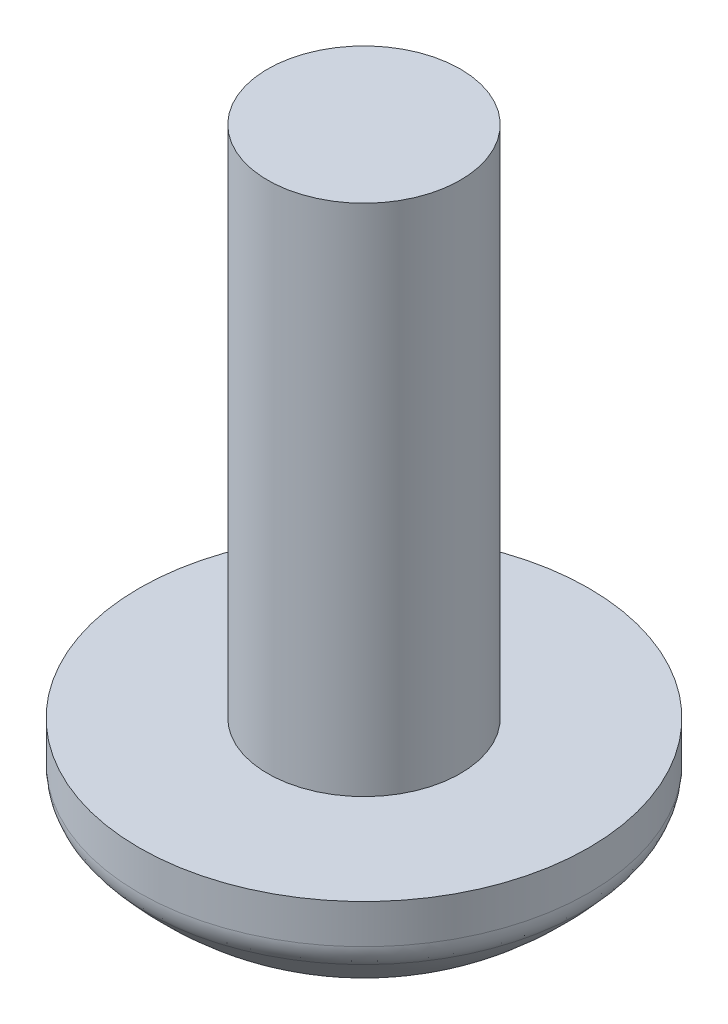
ISO-10303-21;
HEADER;
FILE_DESCRIPTION(('STEP AP214'),'2;1');
FILE_NAME('part.step','',(''),(''),'','','');
FILE_SCHEMA(('AUTOMOTIVE_DESIGN { 1 0 10303 214 1 1 1 1 }'));
ENDSEC;
DATA;
#1=APPLICATION_CONTEXT('core data for automotive mechanical design processes');
#2=APPLICATION_PROTOCOL_DEFINITION('international standard','automotive_design',2000,#1);
#3=PRODUCT_CONTEXT('',#1,'mechanical');
#4=PRODUCT('Part','Part','',(#3));
#5=PRODUCT_RELATED_PRODUCT_CATEGORY('part','',(#4));
#6=PRODUCT_DEFINITION_FORMATION('','',#4);
#7=PRODUCT_DEFINITION_CONTEXT('part definition',#1,'design');
#8=PRODUCT_DEFINITION('design','',#6,#7);
#9=PRODUCT_DEFINITION_SHAPE('','',#8);
#10=(LENGTH_UNIT() NAMED_UNIT(*) SI_UNIT(.MILLI.,.METRE.));
#11=(NAMED_UNIT(*) PLANE_ANGLE_UNIT() SI_UNIT($,.RADIAN.));
#12=(NAMED_UNIT(*) SI_UNIT($,.STERADIAN.) SOLID_ANGLE_UNIT());
#13=UNCERTAINTY_MEASURE_WITH_UNIT(LENGTH_MEASURE(1.E-05),#10,'distance_accuracy_value','');
#14=(GEOMETRIC_REPRESENTATION_CONTEXT(3) GLOBAL_UNCERTAINTY_ASSIGNED_CONTEXT((#13)) GLOBAL_UNIT_ASSIGNED_CONTEXT((#10,
#11,#12)) REPRESENTATION_CONTEXT('',''));
#15=CARTESIAN_POINT('',(0.,0.,0.));
#16=DIRECTION('',(0.,0.,1.));
#17=DIRECTION('',(1.,0.,0.));
#18=AXIS2_PLACEMENT_3D('',#15,#16,#17);
#19=CARTESIAN_POINT('',(0.,-0.459726703238766,1.68219997316542));
#20=DIRECTION('',(0.,-1.,0.));
#21=DIRECTION('',(0.,0.,-1.));
#22=AXIS2_PLACEMENT_3D('',#19,#20,#21);
#23=CYLINDRICAL_SURFACE('',#22,3.5);
#24=CARTESIAN_POINT('',(0.,-1.06903181876256,1.68219997316542));
#25=DIRECTION('',(0.,1.,0.));
#26=DIRECTION('',(0.,0.,1.));
#27=AXIS2_PLACEMENT_3D('',#24,#25,#26);
#28=CIRCLE('',#27,3.5);
#29=CARTESIAN_POINT('',(0.,-1.06903181876256,5.18219997316543));
#30=VERTEX_POINT('',#29);
#31=EDGE_CURVE('E386',#30,#30,#28,.T.);
#32=ORIENTED_EDGE('',*,*,#31,.T.);
#33=EDGE_LOOP('',(#32));
#34=FACE_BOUND('',#33,.T.);
#35=CARTESIAN_POINT('',(0.,-0.459726703238766,1.68219997316542));
#36=DIRECTION('',(0.,-1.,0.));
#37=DIRECTION('',(0.,0.,-1.));
#38=AXIS2_PLACEMENT_3D('',#35,#36,#37);
#39=CIRCLE('',#38,3.5);
#40=CARTESIAN_POINT('',(0.,-0.459726703238766,-1.81780002683458));
#41=VERTEX_POINT('',#40);
#42=EDGE_CURVE('E380',#41,#41,#39,.T.);
#43=ORIENTED_EDGE('',*,*,#42,.T.);
#44=EDGE_LOOP('',(#43));
#45=FACE_BOUND('',#44,.T.);
#46=ADVANCED_FACE('F38',(#34,#45),#23,.T.);
#47=CARTESIAN_POINT('',(0.,-0.459726703238766,-1.81780002683458));
#48=DIRECTION('',(0.,1.,0.));
#49=DIRECTION('',(0.,0.,1.));
#50=AXIS2_PLACEMENT_3D('',#47,#48,#49);
#51=PLANE('',#50);
#52=CARTESIAN_POINT('',(0.,-0.459726703238766,1.68219997316542));
#53=DIRECTION('',(0.,-1.,0.));
#54=DIRECTION('',(0.,0.,-1.));
#55=AXIS2_PLACEMENT_3D('',#52,#53,#54);
#56=CIRCLE('',#55,1.5);
#57=CARTESIAN_POINT('',(0.,-0.459726703238766,0.182199973165424));
#58=VERTEX_POINT('',#57);
#59=EDGE_CURVE('E379',#58,#58,#56,.T.);
#60=ORIENTED_EDGE('',*,*,#59,.T.);
#61=EDGE_LOOP('',(#60));
#62=FACE_BOUND('',#61,.T.);
#63=ORIENTED_EDGE('',*,*,#42,.F.);
#64=EDGE_LOOP('',(#63));
#65=FACE_BOUND('',#64,.T.);
#66=ADVANCED_FACE('F358',(#62,#65),#51,.T.);
#67=CARTESIAN_POINT('',(0.,-0.459726703238766,1.68219997316542));
#68=DIRECTION('',(0.,-1.,0.));
#69=DIRECTION('',(0.,0.,-1.));
#70=AXIS2_PLACEMENT_3D('',#67,#68,#69);
#71=CYLINDRICAL_SURFACE('',#70,1.5);
#72=CARTESIAN_POINT('',(0.,7.54027329676123,1.68219997316542));
#73=DIRECTION('',(0.,-1.,0.));
#74=DIRECTION('',(0.,0.,-1.));
#75=AXIS2_PLACEMENT_3D('',#72,#73,#74);
#76=CIRCLE('',#75,1.5);
#77=CARTESIAN_POINT('',(0.,7.54027329676123,0.182199973165424));
#78=VERTEX_POINT('',#77);
#79=EDGE_CURVE('E181',#78,#78,#76,.T.);
#80=ORIENTED_EDGE('',*,*,#79,.T.);
#81=EDGE_LOOP('',(#80));
#82=FACE_BOUND('',#81,.T.);
#83=ORIENTED_EDGE('',*,*,#59,.F.);
#84=EDGE_LOOP('',(#83));
#85=FACE_BOUND('',#84,.T.);
#86=ADVANCED_FACE('F363',(#82,#85),#71,.T.);
#87=CARTESIAN_POINT('',(0.,7.54027329676123,1.68219997316542));
#88=DIRECTION('',(0.,1.,0.));
#89=DIRECTION('',(0.,0.,1.));
#90=AXIS2_PLACEMENT_3D('',#87,#88,#89);
#91=PLANE('',#90);
#92=ORIENTED_EDGE('',*,*,#79,.F.);
#93=EDGE_LOOP('',(#92));
#94=FACE_BOUND('',#93,.T.);
#95=ADVANCED_FACE('F221',(#94),#91,.T.);
#96=CARTESIAN_POINT('',(0.,-2.95972670323877,1.68219997316542));
#97=CARTESIAN_POINT('',(0.,-2.84056430752141,-0.306624250082899));
#98=CARTESIAN_POINT('',(0.,-2.02578844036261,-1.17776825899481));
#99=CARTESIAN_POINT('',(0.,-1.25200758538791,-1.81780002683458));
#100=B_SPLINE_CURVE_WITH_KNOTS('',3,(#96,#97,#98,#99),.UNSPECIFIED.,.F.,.F.,(4,4),(0.,1.),.UNSPECIFIED.);
#101=CARTESIAN_POINT('',(0.,-0.459726703238766,1.68219997316542));
#102=DIRECTION('',(0.,-1.,0.));
#103=AXIS1_PLACEMENT('',#101,#102);
#104=SURFACE_OF_REVOLUTION('',#100,#103);
#105=CARTESIAN_POINT('',(2.75,-1.97538266649737,1.18219997316542));
#106=CARTESIAN_POINT('',(2.75,-1.99569644264163,1.31884592915908));
#107=CARTESIAN_POINT('',(2.75,-2.00760769847933,1.45678441371395));
#108=CARTESIAN_POINT('',(2.75,-2.01462594430466,1.73186986015496));
#109=CARTESIAN_POINT('',(2.75,-2.00988032499229,1.86901306244241));
#110=CARTESIAN_POINT('',(2.75,-1.99128308097446,2.06446422432555));
#111=CARTESIAN_POINT('',(2.75,-1.98410653292702,2.12345411393049));
#112=CARTESIAN_POINT('',(2.75,-1.97538266649739,2.18219997316528));
#113=B_SPLINE_CURVE_WITH_KNOTS('',3,(#105,#106,#107,#108,#109,#110,#111,#112),.UNSPECIFIED.,.F.,
.F.,(4,2,2,4),(0.,0.414282206966455,0.824907856417591,1.00309698316107),.UNSPECIFIED.);
#114=CARTESIAN_POINT('',(2.75,-1.97538266649737,1.18219997316542));
#115=VERTEX_POINT('',#114);
#116=CARTESIAN_POINT('',(2.74999999999941,-1.97538266649841,2.18219997316538));
#117=VERTEX_POINT('',#116);
#118=EDGE_CURVE('E11',#115,#117,#113,.T.);
#119=ORIENTED_EDGE('',*,*,#118,.F.);
#120=CARTESIAN_POINT('',(0.470758808281623,-2.88524026338165,1.18219997316542));
#121=CARTESIAN_POINT('',(0.542004662792417,-2.87729764894664,1.18219997316542));
#122=CARTESIAN_POINT('',(0.613084927522149,-2.86787744344801,1.18219997316542));
#123=CARTESIAN_POINT('',(0.754789135833399,-2.84609599033659,1.18219997316542));
#124=CARTESIAN_POINT('',(0.82541310569823,-2.83373491370235,1.18219997316542));
#125=CARTESIAN_POINT('',(0.966589136260527,-2.80598641126095,1.18219997316542));
#126=CARTESIAN_POINT('',(1.03713709796704,-2.79057804661767,1.18219997316542));
#127=CARTESIAN_POINT('',(1.17750091286694,-2.7566723016444,1.18219997316542));
#128=CARTESIAN_POINT('',(1.24731660322234,-2.73817424910348,1.18219997316542));
#129=CARTESIAN_POINT('',(1.43028236330932,-2.68511600210193,1.18219997316542));
#130=CARTESIAN_POINT('',(1.54266215682314,-2.64783760861366,1.18219997316542));
#131=CARTESIAN_POINT('',(1.76392187081325,-2.56403195600538,1.18219997316542));
#132=CARTESIAN_POINT('',(1.87280218936971,-2.5175057532197,1.18219997316542));
#133=CARTESIAN_POINT('',(2.08557033138529,-2.41504988061442,1.18219997316542));
#134=CARTESIAN_POINT('',(2.18947495773862,-2.35915522490493,1.18219997316543));
#135=CARTESIAN_POINT('',(2.39160318575382,-2.23799140705744,1.18219997316542));
#136=CARTESIAN_POINT('',(2.48983057788307,-2.17272860349497,1.18219997316542));
#137=CARTESIAN_POINT('',(2.61293513880044,-2.082598544664,1.18219997316542));
#138=CARTESIAN_POINT('',(2.64074499785162,-2.0616561868157,1.18219997316542));
#139=CARTESIAN_POINT('',(2.6957963360839,-2.01905281083415,1.18219997316542));
#140=CARTESIAN_POINT('',(2.72303797246467,-1.99739199587632,1.18219997316543));
#141=CARTESIAN_POINT('',(2.75,-1.97538266649737,1.18219997316542));
#142=B_SPLINE_CURVE_WITH_KNOTS('',3,(#120,#121,#122,#123,#124,#125,#126,#127,#128,#129,#130,
#131,#132,#133,#134,#135,#136,#137,#138,#139,#140,#141),.UNSPECIFIED.,.F.,.F.,(4,2,2,2,2,2,2,2,
2,2,4),(0.,0.215044445767002,0.430076392175597,0.646640714015064,0.863252214400839,
1.21805973275493,1.5728267463592,1.92629625298131,2.27952696882037,2.38395933727035,
2.48836242052614),.UNSPECIFIED.);
#143=CARTESIAN_POINT('',(0.470758808281623,-2.88524026338165,1.18219997316542));
#144=VERTEX_POINT('',#143);
#145=EDGE_CURVE('E52',#144,#115,#142,.T.);
#146=ORIENTED_EDGE('',*,*,#145,.F.);
#147=CARTESIAN_POINT('',(0.470758808281623,-1.97525155911593,-1.07311660714701));
#148=CARTESIAN_POINT('',(0.470758808281623,-2.01874918811076,-1.01996401393127));
#149=CARTESIAN_POINT('',(0.470758808281623,-2.06087772019004,-0.965685121883624));
#150=CARTESIAN_POINT('',(0.470758808281623,-2.14220994860475,-0.854989319968206));
#151=CARTESIAN_POINT('',(0.470758808281623,-2.18141398963491,-0.798572663253516));
#152=CARTESIAN_POINT('',(0.470758808281623,-2.25666361013854,-0.683790774248284));
#153=CARTESIAN_POINT('',(0.470758808281623,-2.29271390848188,-0.625428640127099));
#154=CARTESIAN_POINT('',(0.470758808281623,-2.36163139620041,-0.506852240749729));
#155=CARTESIAN_POINT('',(0.470758808281623,-2.3944982441221,-0.44663777772535));
#156=CARTESIAN_POINT('',(0.470758808281623,-2.47989605606271,-0.279857537145908));
#157=CARTESIAN_POINT('',(0.470758808281623,-2.529210209052,-0.171627095905495));
#158=CARTESIAN_POINT('',(0.470758808281623,-2.61840493355439,0.0486843638263002));
#159=CARTESIAN_POINT('',(0.470758808281623,-2.65828008096221,0.160767554133868));
#160=CARTESIAN_POINT('',(0.470758808281623,-2.72916737233799,0.387765838494003));
#161=CARTESIAN_POINT('',(0.470758808281623,-2.76017316193603,0.502682899140694));
#162=CARTESIAN_POINT('',(0.470758808281623,-2.8139396884138,0.734384826786136));
#163=CARTESIAN_POINT('',(0.470758808281623,-2.83670324075088,0.85116904172534));
#164=CARTESIAN_POINT('',(0.470758808281623,-2.8612007123161,1.00406647677717));
#165=CARTESIAN_POINT('',(0.470758808281623,-2.86652801358584,1.03963011141194));
#166=CARTESIAN_POINT('',(0.470758808281623,-2.87644222603422,1.11084672067808));
#167=CARTESIAN_POINT('',(0.470758808281623,-2.88102941552799,1.14649965658228));
#168=CARTESIAN_POINT('',(0.470758808281623,-2.88524026338165,1.18219997316542));
#169=B_SPLINE_CURVE_WITH_KNOTS('',3,(#147,#148,#149,#150,#151,#152,#153,#154,#155,#156,#157,
#158,#159,#160,#161,#162,#163,#164,#165,#166,#167,#168),.UNSPECIFIED.,.F.,.F.,(4,2,2,2,2,2,2,2,
2,2,4),(0.,0.2060304282566,0.412036534270806,0.617728929060412,0.823443361822867,
1.17974146856868,1.53624382693165,1.89300096207462,2.24963611769048,2.35751238140376,
2.46534798378893),.UNSPECIFIED.);
#170=CARTESIAN_POINT('',(0.470758808281623,-1.97525155911593,-1.07311660714701));
#171=VERTEX_POINT('',#170);
#172=EDGE_CURVE('E301',#171,#144,#169,.T.);
#173=ORIENTED_EDGE('',*,*,#172,.F.);
#174=CARTESIAN_POINT('',(-0.529241191718377,-1.96655788002632,-1.07311660714701));
#175=CARTESIAN_POINT('',(-0.392225096877313,-1.98818427939214,-1.07311660714701));
#176=CARTESIAN_POINT('',(-0.253826941492258,-2.00133118631484,-1.07311660714701));
#177=CARTESIAN_POINT('',(0.0223085454396417,-2.01064916382581,-1.07311660714701));
#178=CARTESIAN_POINT('',(0.16004082065965,-2.00697004687227,-1.07311660714701));
#179=CARTESIAN_POINT('',(0.35507930449322,-1.98990183918733,-1.07311660714701));
#180=CARTESIAN_POINT('',(0.413030567057368,-1.98332350013926,-1.07311660714701));
#181=CARTESIAN_POINT('',(0.470758808281623,-1.97525155911593,-1.07311660714701));
#182=B_SPLINE_CURVE_WITH_KNOTS('',3,(#174,#175,#176,#177,#178,#179,#180,#181),.UNSPECIFIED.,.F.,
.F.,(4,2,2,4),(0.,0.415973375059245,0.828250329477264,1.00313958524149),.UNSPECIFIED.);
#183=CARTESIAN_POINT('',(-0.529241191718377,-1.96655788002632,-1.07311660714701));
#184=VERTEX_POINT('',#183);
#185=EDGE_CURVE('E294',#184,#171,#182,.T.);
#186=ORIENTED_EDGE('',*,*,#185,.F.);
#187=CARTESIAN_POINT('',(-0.529241191718377,-2.87839874159951,1.18219997316542));
#188=CARTESIAN_POINT('',(-0.529241191718377,-2.86995991088716,1.10980388341635));
#189=CARTESIAN_POINT('',(-0.529241191718377,-2.85999301826502,1.03758588342592));
#190=CARTESIAN_POINT('',(-0.529241191718377,-2.83700047184,0.893640399926071));
#191=CARTESIAN_POINT('',(-0.529241191718377,-2.82397489125739,0.821912904717018));
#192=CARTESIAN_POINT('',(-0.529241191718377,-2.79476040614694,0.678581204966709));
#193=CARTESIAN_POINT('',(-0.529241191718377,-2.77855007313706,0.606981349211547));
#194=CARTESIAN_POINT('',(-0.529241191718377,-2.7428974871617,0.464577428181727));
#195=CARTESIAN_POINT('',(-0.529241191718377,-2.7234545838682,0.393773526103151));
#196=CARTESIAN_POINT('',(-0.529241191718376,-2.66868796999526,0.211568073592224));
#197=CARTESIAN_POINT('',(-0.529241191718377,-2.63077382687567,0.100928563411789));
#198=CARTESIAN_POINT('',(-0.529241191718377,-2.54585150811531,-0.116806525686358));
#199=CARTESIAN_POINT('',(-0.529241191718377,-2.49884432497134,-0.223902489886186));
#200=CARTESIAN_POINT('',(-0.529241191718377,-2.39564022777442,-0.433105411385817));
#201=CARTESIAN_POINT('',(-0.529241191718377,-2.33947700379817,-0.535228940187176));
#202=CARTESIAN_POINT('',(-0.529241191718377,-2.21804212275881,-0.733846325862485));
#203=CARTESIAN_POINT('',(-0.529241191718378,-2.15277647142804,-0.830343835702906));
#204=CARTESIAN_POINT('',(-0.529241191718377,-2.06448755679478,-0.949060203647979));
#205=CARTESIAN_POINT('',(-0.529241191718377,-2.04531089179406,-0.974200108690336));
#206=CARTESIAN_POINT('',(-0.529241191718377,-2.00637060439221,-1.02400886725635));
#207=CARTESIAN_POINT('',(-0.529241191718377,-1.98660716312019,-1.04867786235811));
#208=CARTESIAN_POINT('',(-0.529241191718377,-1.96655788002632,-1.07311660714701));
#209=B_SPLINE_CURVE_WITH_KNOTS('',3,(#187,#188,#189,#190,#191,#192,#193,#194,#195,#196,#197,
#198,#199,#200,#201,#202,#203,#204,#205,#206,#207,#208),.UNSPECIFIED.,.F.,.F.,(4,2,2,2,2,2,2,2,
2,2,4),(0.,0.218642096423898,0.437278959427696,0.657440667906297,0.877646722198846,
1.22812112752948,1.57855730047016,1.92773198291301,2.27667736220282,2.3715290000891,
2.46635165701784),.UNSPECIFIED.);
#210=CARTESIAN_POINT('',(-0.529241191718377,-2.87839874159951,1.18219997316542));
#211=VERTEX_POINT('',#210);
#212=EDGE_CURVE('E286',#211,#184,#209,.T.);
#213=ORIENTED_EDGE('',*,*,#212,.F.);
#214=CARTESIAN_POINT('',(-2.75,-1.97538266649736,1.18219997316542));
#215=CARTESIAN_POINT('',(-2.69681334278906,-2.01882217781939,1.18219997316542));
#216=CARTESIAN_POINT('',(-2.64250138570515,-2.06089103555264,1.18219997316542));
#217=CARTESIAN_POINT('',(-2.53174206361007,-2.14210143520268,1.18219997316542));
#218=CARTESIAN_POINT('',(-2.47529495132573,-2.18124332194674,1.18219997316542));
#219=CARTESIAN_POINT('',(-2.3604440223686,-2.25637431661225,1.18219997316542));
#220=CARTESIAN_POINT('',(-2.30204289653258,-2.29236753194934,1.18219997316542));
#221=CARTESIAN_POINT('',(-2.18339135098548,-2.36116817137666,1.18219997316542));
#222=CARTESIAN_POINT('',(-2.12314073577824,-2.39397525714744,1.18219997316542));
#223=CARTESIAN_POINT('',(-1.95632100514546,-2.47917843589097,1.18219997316542));
#224=CARTESIAN_POINT('',(-1.84809281508346,-2.52836043314668,1.18219997316542));
#225=CARTESIAN_POINT('',(-1.6277963203827,-2.61729305268747,1.18219997316542));
#226=CARTESIAN_POINT('',(-1.51572581799735,-2.65703817063432,1.18219997316542));
#227=CARTESIAN_POINT('',(-1.28878496242494,-2.72765176617234,1.18219997316542));
#228=CARTESIAN_POINT('',(-1.17391322502807,-2.75851575468794,1.18219997316542));
#229=CARTESIAN_POINT('',(-0.9423095906536,-2.81197628586008,1.18219997316542));
#230=CARTESIAN_POINT('',(-0.825578422784906,-2.83457598964816,1.18219997316542));
#231=CARTESIAN_POINT('',(-0.678481645509904,-2.8579101692125,1.18219997316542));
#232=CARTESIAN_POINT('',(-0.648678795283765,-2.86237513238264,1.18219997316542));
#233=CARTESIAN_POINT('',(-0.589009288130021,-2.87078138350605,1.18219997316542));
#234=CARTESIAN_POINT('',(-0.559142655233716,-2.87472284209687,1.18219997316542));
#235=CARTESIAN_POINT('',(-0.529241191718373,-2.87839874159951,1.18219997316542));
#236=B_SPLINE_CURVE_WITH_KNOTS('',3,(#214,#215,#216,#217,#218,#219,#220,#221,#222,#223,#224,
#225,#226,#227,#228,#229,#230,#231,#232,#233,#234,#235),.UNSPECIFIED.,.F.,.F.,(4,2,2,2,2,2,2,2,
2,2,4),(0.,0.205999110528866,0.411973913885809,0.617675888299581,0.82339968136858,
1.17952810329957,1.53586374013494,1.89237917605537,2.24875809998541,2.33916188796546,
2.4295361359193),.UNSPECIFIED.);
#237=CARTESIAN_POINT('',(-2.75,-1.97538266649736,1.18219997316542));
#238=VERTEX_POINT('',#237);
#239=EDGE_CURVE('E278',#238,#211,#236,.T.);
#240=ORIENTED_EDGE('',*,*,#239,.F.);
#241=CARTESIAN_POINT('',(-2.74999999999905,-1.97538266649909,2.18219997316526));
#242=CARTESIAN_POINT('',(-2.74999999999966,-1.99569644264225,2.04555401717161));
#243=CARTESIAN_POINT('',(-2.74999999999991,-2.00760769847949,1.9076155326168));
#244=CARTESIAN_POINT('',(-2.75000000000009,-2.01462594430449,1.63253008617593));
#245=CARTESIAN_POINT('',(-2.75000000000003,-2.00988032499224,1.49538688388855));
#246=CARTESIAN_POINT('',(-2.74999999999999,-1.99128308097449,1.29993572200538));
#247=CARTESIAN_POINT('',(-2.74999999999998,-1.98410653292704,1.24094583240032));
#248=CARTESIAN_POINT('',(-2.75,-1.97538266649736,1.18219997316542));
#249=B_SPLINE_CURVE_WITH_KNOTS('',3,(#241,#242,#243,#244,#245,#246,#247,#248),.UNSPECIFIED.,.F.,
.F.,(4,2,2,4),(0.,0.414282206966154,0.824907856417095,1.0030969831609),.UNSPECIFIED.);
#250=CARTESIAN_POINT('',(-2.75,-1.97538266649909,2.18219997316542));
#251=VERTEX_POINT('',#250);
#252=EDGE_CURVE('E270',#251,#238,#249,.T.);
#253=ORIENTED_EDGE('',*,*,#252,.F.);
#254=CARTESIAN_POINT('',(-0.529241191718377,-2.87839874159951,2.18219997316542));
#255=CARTESIAN_POINT('',(-0.602336638562616,-2.86938318800737,2.18219997316542));
#256=CARTESIAN_POINT('',(-0.675245075878459,-2.8588353494829,2.18219997316542));
#257=CARTESIAN_POINT('',(-0.820540862391529,-2.83464748041608,2.18219997316542));
#258=CARTESIAN_POINT('',(-0.892928252651024,-2.82100769635604,2.18219997316542));
#259=CARTESIAN_POINT('',(-1.03604283766155,-2.79081861718261,2.18219997316542));
#260=CARTESIAN_POINT('',(-1.10677911278365,-2.77431249596757,2.18219997316542));
#261=CARTESIAN_POINT('',(-1.24745940091214,-2.73812741622443,2.18219997316542));
#262=CARTESIAN_POINT('',(-1.31740317381364,-2.7184475222669,2.18219997316542));
#263=CARTESIAN_POINT('',(-1.46825312750653,-2.67209538130628,2.18219997316542));
#264=CARTESIAN_POINT('',(-1.54897017113093,-2.64480257051819,2.18219997316542));
#265=CARTESIAN_POINT('',(-1.70865153476749,-2.58543986499239,2.18219997316542));
#266=CARTESIAN_POINT('',(-1.78761551251492,-2.55336904666911,2.18219997316542));
#267=CARTESIAN_POINT('',(-1.94335050837755,-2.48430575746703,2.18219997316542));
#268=CARTESIAN_POINT('',(-2.02012190659136,-2.44731414600962,2.18219997316542));
#269=CARTESIAN_POINT('',(-2.1728943180138,-2.36740692002348,2.18219997316542));
#270=CARTESIAN_POINT('',(-2.24883193740333,-2.32436980203009,2.18219997316542));
#271=CARTESIAN_POINT('',(-2.39760702571394,-2.23315476006569,2.18219997316542));
#272=CARTESIAN_POINT('',(-2.47044284375759,-2.18497414523892,2.18219997316542));
#273=CARTESIAN_POINT('',(-2.61280402132457,-2.08374243289212,2.18219997316542));
#274=CARTESIAN_POINT('',(-2.68232455727412,-2.0306845489376,2.18219997316543));
#275=CARTESIAN_POINT('',(-2.74999999999881,-1.97538266649834,2.18219997316543));
#276=B_SPLINE_CURVE_WITH_KNOTS('',3,(#254,#255,#256,#257,#258,#259,#260,#261,#262,#263,#264,
#265,#266,#267,#268,#269,#270,#271,#272,#273,#274,#275),.UNSPECIFIED.,.F.,.F.,(4,2,2,2,2,2,2,2,
2,2,4),(0.,0.220934566113985,0.441851526056471,0.659691268632579,0.87759533446056,
1.13306944452342,1.38859300178339,1.64407199005107,1.90572160672413,2.16750878429859,
2.42966590245383),.UNSPECIFIED.);
#277=CARTESIAN_POINT('',(-0.529241191718377,-2.87839874159951,2.18219997316542));
#278=VERTEX_POINT('',#277);
#279=EDGE_CURVE('E262',#278,#251,#276,.T.);
#280=ORIENTED_EDGE('',*,*,#279,.F.);
#281=CARTESIAN_POINT('',(-0.529241191718377,-1.97525155911593,4.42688339285299));
#282=CARTESIAN_POINT('',(-0.529241191718377,-2.01864408734527,4.37365376977176));
#283=CARTESIAN_POINT('',(-0.529241191718377,-2.06066399074455,4.31929939432614));
#284=CARTESIAN_POINT('',(-0.529241191718377,-2.141772982619,4.2084569250644));
#285=CARTESIAN_POINT('',(-0.529241191718377,-2.18086241544811,4.15196908312458));
#286=CARTESIAN_POINT('',(-0.529241191718377,-2.2558863571949,4.03703770994353));
#287=CARTESIAN_POINT('',(-0.529241191718377,-2.29182490515013,3.97859681910924));
#288=CARTESIAN_POINT('',(-0.529241191718377,-2.36051332260498,3.85986831489815));
#289=CARTESIAN_POINT('',(-0.529241191718377,-2.39326285473539,3.79958050701913));
#290=CARTESIAN_POINT('',(-0.529241191718377,-2.47826304358721,3.63274578083163));
#291=CARTESIAN_POINT('',(-0.529241191718377,-2.52730453059456,3.52454641409848));
#292=CARTESIAN_POINT('',(-0.529241191718377,-2.61596142546452,3.3043200564881));
#293=CARTESIAN_POINT('',(-0.529241191718377,-2.65557132647055,3.19229087291779));
#294=CARTESIAN_POINT('',(-0.529241191718377,-2.72591342053655,2.96543351372644));
#295=CARTESIAN_POINT('',(-0.529241191718377,-2.75664055215739,2.8506037825882));
#296=CARTESIAN_POINT('',(-0.529241191718377,-2.80980358557153,2.61908723663335));
#297=CARTESIAN_POINT('',(-0.529241191718377,-2.83224257809151,2.50240113104266));
#298=CARTESIAN_POINT('',(-0.529241191718377,-2.8559609773688,2.35138360345123));
#299=CARTESIAN_POINT('',(-0.529241191718377,-2.86092618738789,2.31760396928331));
#300=CARTESIAN_POINT('',(-0.529241191718377,-2.87017586513667,2.24996387328707));
#301=CARTESIAN_POINT('',(-0.529241191718378,-2.87446057360596,2.21610344436349));
#302=CARTESIAN_POINT('',(-0.529241191718379,-2.87839874159951,2.18219997316539));
#303=B_SPLINE_CURVE_WITH_KNOTS('',3,(#281,#282,#283,#284,#285,#286,#287,#288,#289,#290,#291,
#292,#293,#294,#295,#296,#297,#298,#299,#300,#301,#302),.UNSPECIFIED.,.F.,.F.,(4,2,2,2,2,2,2,2,
2,2,4),(0.,0.206009799426912,0.411995352972234,0.6177128758404,0.823452138182176,
1.17932847293723,1.5354120878467,1.8916982025593,2.24785132029834,2.35027475843367,
2.45266188134672),.UNSPECIFIED.);
#304=CARTESIAN_POINT('',(-0.529241191718377,-1.97525155911593,4.42688339285299));
#305=VERTEX_POINT('',#304);
#306=EDGE_CURVE('E254',#305,#278,#303,.T.);
#307=ORIENTED_EDGE('',*,*,#306,.F.);
#308=CARTESIAN_POINT('',(0.470758808281623,-1.98391897348609,4.42688339285299));
#309=CARTESIAN_POINT('',(0.334460613843363,-2.00293933105485,4.42688339285299));
#310=CARTESIAN_POINT('',(0.196956719912193,-2.01362993380292,4.42688339285299));
#311=CARTESIAN_POINT('',(-0.0771309697348678,-2.01836914789154,4.42688339285299));
#312=CARTESIAN_POINT('',(-0.213712258552143,-2.0125628909656,4.42688339285299));
#313=CARTESIAN_POINT('',(-0.409552781470726,-1.99242431599254,4.42688339285299));
#314=CARTESIAN_POINT('',(-0.469529839519263,-1.9846376587369,4.42688339285299));
#315=CARTESIAN_POINT('',(-0.529241191718377,-1.97525155911593,4.42688339285299));
#316=B_SPLINE_CURVE_WITH_KNOTS('',3,(#308,#309,#310,#311,#312,#313,#314,#315),.UNSPECIFIED.,.F.,
.F.,(4,2,2,4),(0.,0.412699104146755,0.821778743995289,1.00313037713909),.UNSPECIFIED.);
#317=CARTESIAN_POINT('',(0.470758808281623,-1.98391897348609,4.42688339285299));
#318=VERTEX_POINT('',#317);
#319=EDGE_CURVE('E246',#318,#305,#316,.T.);
#320=ORIENTED_EDGE('',*,*,#319,.F.);
#321=CARTESIAN_POINT('',(0.470758808281623,-2.88524026338165,2.18219997316542));
#322=CARTESIAN_POINT('',(0.470758808281623,-2.87681603462301,2.25338248364463));
#323=CARTESIAN_POINT('',(0.470758808281623,-2.86694422638889,2.32439406704684));
#324=CARTESIAN_POINT('',(0.470758808281623,-2.84429343337507,2.46594959131667));
#325=CARTESIAN_POINT('',(0.470758808281623,-2.8315145380988,2.53649354651282));
#326=CARTESIAN_POINT('',(0.470758808281623,-2.80293519001327,2.67749490055679));
#327=CARTESIAN_POINT('',(0.470758808281623,-2.78711377854471,2.74794807112859));
#328=CARTESIAN_POINT('',(0.470758808281623,-2.7523789106023,2.8881014372456));
#329=CARTESIAN_POINT('',(0.470758808281623,-2.73346481641441,2.95780147432723));
#330=CARTESIAN_POINT('',(0.470758808281623,-2.67943968262045,3.13994957522974));
#331=CARTESIAN_POINT('',(0.470758808281623,-2.64163955179759,3.25161788243498));
#332=CARTESIAN_POINT('',(0.470758808281623,-2.55684733666256,3.4714116815425));
#333=CARTESIAN_POINT('',(0.470758808281623,-2.50985629808411,3.57953757486511));
#334=CARTESIAN_POINT('',(0.470758808281623,-2.40655629855938,3.79076166779873));
#335=CARTESIAN_POINT('',(0.470758808281623,-2.35028246620243,3.89387699355584));
#336=CARTESIAN_POINT('',(0.470758808281624,-2.22847180245868,4.09441905969904));
#337=CARTESIAN_POINT('',(0.470758808281625,-2.16294131410769,4.19184963143965));
#338=CARTESIAN_POINT('',(0.470758808281624,-2.07549824141429,4.30995879782493));
#339=CARTESIAN_POINT('',(0.470758808281623,-2.05754641066655,4.3336334825978));
#340=CARTESIAN_POINT('',(0.470758808281623,-2.02112091077836,4.38056753010988));
#341=CARTESIAN_POINT('',(0.470758808281622,-2.00264738723274,4.40382700582576));
#342=CARTESIAN_POINT('',(0.470758808281623,-1.98391897348609,4.42688339285299));
#343=B_SPLINE_CURVE_WITH_KNOTS('',3,(#321,#322,#323,#324,#325,#326,#327,#328,#329,#330,#331,
#332,#333,#334,#335,#336,#337,#338,#339,#340,#341,#342),.UNSPECIFIED.,.F.,.F.,(4,2,2,2,2,2,2,2,
2,2,4),(0.,0.215023057226017,0.430039495216543,0.646593892440443,0.863192999824208,
1.21647536536731,1.56971755809987,1.92165242692939,2.27334729516423,2.36247696311167,
2.4515819977589),.UNSPECIFIED.);
#344=CARTESIAN_POINT('',(0.470758808281623,-2.88524026338165,2.18219997316542));
#345=VERTEX_POINT('',#344);
#346=EDGE_CURVE('E238',#345,#318,#343,.T.);
#347=ORIENTED_EDGE('',*,*,#346,.F.);
#348=CARTESIAN_POINT('',(2.74999999999941,-1.97538266649841,2.18219997316538));
#349=CARTESIAN_POINT('',(2.69680889805728,-2.01882581384825,2.18219997316541));
#350=CARTESIAN_POINT('',(2.642492302507,-2.06089807501894,2.18219997316542));
#351=CARTESIAN_POINT('',(2.53172339960419,-2.14211474309587,2.18219997316543));
#352=CARTESIAN_POINT('',(2.47527134677833,-2.18125949728835,2.18219997316543));
#353=CARTESIAN_POINT('',(2.36041973144163,-2.25638947205456,2.18219997316542));
#354=CARTESIAN_POINT('',(2.30202319568905,-2.29237931290982,2.18219997316542));
#355=CARTESIAN_POINT('',(2.18338123098079,-2.36117368186186,2.18219997316542));
#356=CARTESIAN_POINT('',(2.12313560892617,-2.39397787578381,2.18219997316542));
#357=CARTESIAN_POINT('',(1.95633701755339,-2.47917025738621,2.18219997316542));
#358=CARTESIAN_POINT('',(1.84812557666549,-2.52834554600864,2.18219997316542));
#359=CARTESIAN_POINT('',(1.62786218903923,-2.617268126676,2.18219997316542));
#360=CARTESIAN_POINT('',(1.51580799321966,-2.65700978580125,2.18219997316542));
#361=CARTESIAN_POINT('',(1.28886233635126,-2.72763050717427,2.18219997316542));
#362=CARTESIAN_POINT('',(1.17396858724683,-2.75850215132921,2.18219997316542));
#363=CARTESIAN_POINT('',(0.942332944015773,-2.81197172190262,2.18219997316542));
#364=CARTESIAN_POINT('',(0.825591956817109,-2.83457358458027,2.18219997316542));
#365=CARTESIAN_POINT('',(0.668753495137448,-2.85945344698641,2.18219997316542));
#366=CARTESIAN_POINT('',(0.629192654654177,-2.86526669853853,2.18219997316542));
#367=CARTESIAN_POINT('',(0.550026044785571,-2.87595633165847,2.18219997316542));
#368=CARTESIAN_POINT('',(0.510420527547678,-2.88083458183608,2.18219997316542));
#369=CARTESIAN_POINT('',(0.470758808281623,-2.88524026338165,2.18219997316542));
#370=B_SPLINE_CURVE_WITH_KNOTS('',3,(#348,#349,#350,#351,#352,#353,#354,#355,#356,#357,#358,
#359,#360,#361,#362,#363,#364,#365,#366,#367,#368,#369),.UNSPECIFIED.,.F.,.F.,(4,2,2,2,2,2,2,2,
2,2,4),(0.,0.20601633726484,0.412008196192902,0.617693162337305,0.82339968161034,
1.17947416224919,1.53576072687285,1.89234439636393,2.24875811731149,2.36870746767319,
2.48841453967682),.UNSPECIFIED.);
#371=EDGE_CURVE('E229',#117,#345,#370,.T.);
#372=ORIENTED_EDGE('',*,*,#371,.F.);
#373=EDGE_LOOP('',(#119,#146,#173,#186,#213,#240,#253,#280,#307,#320,#347,#372));
#374=FACE_BOUND('',#373,.T.);
#375=CARTESIAN_POINT('',(0.,-1.39637844235989,1.68219997316542));
#376=DIRECTION('',(0.,-1.,0.));
#377=DIRECTION('',(0.,0.,-1.));
#378=AXIS2_PLACEMENT_3D('',#375,#376,#377);
#379=CIRCLE('',#378,3.37794733498125);
#380=CARTESIAN_POINT('',(0.,-1.39637844235989,-1.69574736181583));
#381=VERTEX_POINT('',#380);
#382=EDGE_CURVE('E382',#381,#381,#379,.T.);
#383=ORIENTED_EDGE('',*,*,#382,.T.);
#384=EDGE_LOOP('',(#383));
#385=FACE_BOUND('',#384,.T.);
#386=ADVANCED_FACE('F217',(#374,#385),#104,.F.);
#387=CARTESIAN_POINT('',(0.,-1.06903181876256,1.68219997316542));
#388=DIRECTION('',(0.,1.,0.));
#389=DIRECTION('',(0.,0.,1.));
#390=AXIS2_PLACEMENT_3D('',#387,#388,#389);
#391=TOROIDAL_SURFACE('',#390,3.,0.5);
#392=ORIENTED_EDGE('',*,*,#31,.F.);
#393=EDGE_LOOP('',(#392));
#394=FACE_BOUND('',#393,.T.);
#395=ORIENTED_EDGE('',*,*,#382,.F.);
#396=EDGE_LOOP('',(#395));
#397=FACE_BOUND('',#396,.T.);
#398=ADVANCED_FACE('F40',(#394,#397),#391,.T.);
#399=CARTESIAN_POINT('',(2.75,-1.45972670323877,2.18219997316542));
#400=DIRECTION('',(1.,0.,0.));
#401=DIRECTION('',(0.,0.,-1.));
#402=AXIS2_PLACEMENT_3D('',#399,#400,#401);
#403=PLANE('',#402);
#404=ORIENTED_EDGE('',*,*,#118,.T.);
#405=DIRECTION('',(0.,-1.,0.));
#406=VECTOR('',#405,1.);
#407=CARTESIAN_POINT('',(2.75,-1.45972670323877,2.18219997316542));
#408=LINE('',#407,#406);
#409=CARTESIAN_POINT('',(2.75,-1.45972670323877,2.18219997316542));
#410=VERTEX_POINT('',#409);
#411=EDGE_CURVE('E59',#410,#117,#408,.T.);
#412=ORIENTED_EDGE('',*,*,#411,.F.);
#413=DIRECTION('',(0.,0.,1.));
#414=VECTOR('',#413,1.);
#415=CARTESIAN_POINT('',(2.75,-1.45972670323877,2.18219997316542));
#416=LINE('',#415,#414);
#417=CARTESIAN_POINT('',(2.75,-1.45972670323877,1.18219997316542));
#418=VERTEX_POINT('',#417);
#419=EDGE_CURVE('E133',#418,#410,#416,.T.);
#420=ORIENTED_EDGE('',*,*,#419,.F.);
#421=DIRECTION('',(0.,-1.,0.));
#422=VECTOR('',#421,1.);
#423=CARTESIAN_POINT('',(2.75,-1.45972670323877,1.18219997316542));
#424=LINE('',#423,#422);
#425=EDGE_CURVE('E179',#418,#115,#424,.T.);
#426=ORIENTED_EDGE('',*,*,#425,.T.);
#427=EDGE_LOOP('',(#404,#412,#420,#426));
#428=FACE_BOUND('',#427,.T.);
#429=ADVANCED_FACE('F131',(#428),#403,.F.);
#430=CARTESIAN_POINT('',(0.470758808281623,-1.45972670323877,1.18219997316542));
#431=DIRECTION('',(0.,0.,-1.));
#432=DIRECTION('',(-1.,0.,0.));
#433=AXIS2_PLACEMENT_3D('',#430,#431,#432);
#434=PLANE('',#433);
#435=ORIENTED_EDGE('',*,*,#145,.T.);
#436=ORIENTED_EDGE('',*,*,#425,.F.);
#437=DIRECTION('',(1.,0.,0.));
#438=VECTOR('',#437,1.);
#439=CARTESIAN_POINT('',(0.470758808281623,-1.45972670323877,1.18219997316542));
#440=LINE('',#439,#438);
#441=CARTESIAN_POINT('',(0.470758808281623,-1.45972670323877,1.18219997316542));
#442=VERTEX_POINT('',#441);
#443=EDGE_CURVE('E138',#442,#418,#440,.T.);
#444=ORIENTED_EDGE('',*,*,#443,.F.);
#445=DIRECTION('',(0.,-1.,0.));
#446=VECTOR('',#445,1.);
#447=CARTESIAN_POINT('',(0.470758808281623,-1.45972670323877,1.18219997316542));
#448=LINE('',#447,#446);
#449=EDGE_CURVE('E182',#442,#144,#448,.T.);
#450=ORIENTED_EDGE('',*,*,#449,.T.);
#451=EDGE_LOOP('',(#435,#436,#444,#450));
#452=FACE_BOUND('',#451,.T.);
#453=ADVANCED_FACE('F312',(#452),#434,.F.);
#454=CARTESIAN_POINT('',(0.470758808281623,-1.45972670323877,1.18219997316542));
#455=DIRECTION('',(1.,0.,0.));
#456=DIRECTION('',(0.,0.,-1.));
#457=AXIS2_PLACEMENT_3D('',#454,#455,#456);
#458=PLANE('',#457);
#459=ORIENTED_EDGE('',*,*,#172,.T.);
#460=ORIENTED_EDGE('',*,*,#449,.F.);
#461=DIRECTION('',(0.,0.,1.));
#462=VECTOR('',#461,1.);
#463=CARTESIAN_POINT('',(0.470758808281623,-1.45972670323877,1.18219997316542));
#464=LINE('',#463,#462);
#465=CARTESIAN_POINT('',(0.470758808281623,-1.45972670323877,-1.07311660714701));
#466=VERTEX_POINT('',#465);
#467=EDGE_CURVE('E176',#466,#442,#464,.T.);
#468=ORIENTED_EDGE('',*,*,#467,.F.);
#469=DIRECTION('',(0.,-1.,0.));
#470=VECTOR('',#469,1.);
#471=CARTESIAN_POINT('',(0.470758808281623,-1.45972670323877,-1.07311660714701));
#472=LINE('',#471,#470);
#473=EDGE_CURVE('E184',#466,#171,#472,.T.);
#474=ORIENTED_EDGE('',*,*,#473,.T.);
#475=EDGE_LOOP('',(#459,#460,#468,#474));
#476=FACE_BOUND('',#475,.T.);
#477=ADVANCED_FACE('F316',(#476),#458,.F.);
#478=CARTESIAN_POINT('',(-0.529241191718377,-1.45972670323877,-1.07311660714701));
#479=DIRECTION('',(0.,0.,-1.));
#480=DIRECTION('',(-1.,0.,0.));
#481=AXIS2_PLACEMENT_3D('',#478,#479,#480);
#482=PLANE('',#481);
#483=ORIENTED_EDGE('',*,*,#185,.T.);
#484=ORIENTED_EDGE('',*,*,#473,.F.);
#485=DIRECTION('',(1.,0.,0.));
#486=VECTOR('',#485,1.);
#487=CARTESIAN_POINT('',(-0.529241191718377,-1.45972670323877,-1.07311660714701));
#488=LINE('',#487,#486);
#489=CARTESIAN_POINT('',(-0.529241191718377,-1.45972670323877,-1.07311660714701));
#490=VERTEX_POINT('',#489);
#491=EDGE_CURVE('E173',#490,#466,#488,.T.);
#492=ORIENTED_EDGE('',*,*,#491,.F.);
#493=DIRECTION('',(0.,-1.,0.));
#494=VECTOR('',#493,1.);
#495=CARTESIAN_POINT('',(-0.529241191718377,-1.45972670323877,-1.07311660714701));
#496=LINE('',#495,#494);
#497=EDGE_CURVE('E187',#490,#184,#496,.T.);
#498=ORIENTED_EDGE('',*,*,#497,.T.);
#499=EDGE_LOOP('',(#483,#484,#492,#498));
#500=FACE_BOUND('',#499,.T.);
#501=ADVANCED_FACE('F319',(#500),#482,.F.);
#502=CARTESIAN_POINT('',(-0.529241191718377,-1.45972670323877,1.18219997316542));
#503=DIRECTION('',(-1.,0.,0.));
#504=DIRECTION('',(0.,0.,1.));
#505=AXIS2_PLACEMENT_3D('',#502,#503,#504);
#506=PLANE('',#505);
#507=ORIENTED_EDGE('',*,*,#212,.T.);
#508=ORIENTED_EDGE('',*,*,#497,.F.);
#509=DIRECTION('',(0.,0.,-1.));
#510=VECTOR('',#509,1.);
#511=CARTESIAN_POINT('',(-0.529241191718377,-1.45972670323877,1.18219997316542));
#512=LINE('',#511,#510);
#513=CARTESIAN_POINT('',(-0.529241191718377,-1.45972670323877,1.18219997316542));
#514=VERTEX_POINT('',#513);
#515=EDGE_CURVE('E170',#514,#490,#512,.T.);
#516=ORIENTED_EDGE('',*,*,#515,.F.);
#517=DIRECTION('',(0.,-1.,0.));
#518=VECTOR('',#517,1.);
#519=CARTESIAN_POINT('',(-0.529241191718377,-1.45972670323877,1.18219997316542));
#520=LINE('',#519,#518);
#521=EDGE_CURVE('E190',#514,#211,#520,.T.);
#522=ORIENTED_EDGE('',*,*,#521,.T.);
#523=EDGE_LOOP('',(#507,#508,#516,#522));
#524=FACE_BOUND('',#523,.T.);
#525=ADVANCED_FACE('F323',(#524),#506,.F.);
#526=CARTESIAN_POINT('',(-2.75,-1.45972670323877,1.18219997316542));
#527=DIRECTION('',(0.,0.,-1.));
#528=DIRECTION('',(0.,1.,0.));
#529=AXIS2_PLACEMENT_3D('',#526,#527,#528);
#530=PLANE('',#529);
#531=ORIENTED_EDGE('',*,*,#239,.T.);
#532=ORIENTED_EDGE('',*,*,#521,.F.);
#533=DIRECTION('',(1.,0.,0.));
#534=VECTOR('',#533,1.);
#535=CARTESIAN_POINT('',(-2.75,-1.45972670323877,1.18219997316542));
#536=LINE('',#535,#534);
#537=CARTESIAN_POINT('',(-2.75,-1.45972670323877,1.18219997316542));
#538=VERTEX_POINT('',#537);
#539=EDGE_CURVE('E167',#538,#514,#536,.T.);
#540=ORIENTED_EDGE('',*,*,#539,.F.);
#541=DIRECTION('',(0.,-1.,0.));
#542=VECTOR('',#541,1.);
#543=CARTESIAN_POINT('',(-2.75,-1.45972670323877,1.18219997316542));
#544=LINE('',#543,#542);
#545=EDGE_CURVE('E193',#538,#238,#544,.T.);
#546=ORIENTED_EDGE('',*,*,#545,.T.);
#547=EDGE_LOOP('',(#531,#532,#540,#546));
#548=FACE_BOUND('',#547,.T.);
#549=ADVANCED_FACE('F327',(#548),#530,.F.);
#550=CARTESIAN_POINT('',(-2.75,-1.45972670323877,2.18219997316542));
#551=DIRECTION('',(-1.,0.,0.));
#552=DIRECTION('',(0.,0.,1.));
#553=AXIS2_PLACEMENT_3D('',#550,#551,#552);
#554=PLANE('',#553);
#555=ORIENTED_EDGE('',*,*,#252,.T.);
#556=ORIENTED_EDGE('',*,*,#545,.F.);
#557=DIRECTION('',(0.,0.,-1.));
#558=VECTOR('',#557,1.);
#559=CARTESIAN_POINT('',(-2.75,-1.45972670323877,2.18219997316542));
#560=LINE('',#559,#558);
#561=CARTESIAN_POINT('',(-2.75,-1.45972670323877,2.18219997316542));
#562=VERTEX_POINT('',#561);
#563=EDGE_CURVE('E164',#562,#538,#560,.T.);
#564=ORIENTED_EDGE('',*,*,#563,.F.);
#565=DIRECTION('',(0.,-1.,0.));
#566=VECTOR('',#565,1.);
#567=CARTESIAN_POINT('',(-2.75,-1.45972670323877,2.18219997316542));
#568=LINE('',#567,#566);
#569=EDGE_CURVE('E196',#562,#251,#568,.T.);
#570=ORIENTED_EDGE('',*,*,#569,.T.);
#571=EDGE_LOOP('',(#555,#556,#564,#570));
#572=FACE_BOUND('',#571,.T.);
#573=ADVANCED_FACE('F331',(#572),#554,.F.);
#574=CARTESIAN_POINT('',(-2.75,-1.45972670323877,2.18219997316542));
#575=DIRECTION('',(0.,0.,1.));
#576=DIRECTION('',(1.,0.,0.));
#577=AXIS2_PLACEMENT_3D('',#574,#575,#576);
#578=PLANE('',#577);
#579=ORIENTED_EDGE('',*,*,#279,.T.);
#580=ORIENTED_EDGE('',*,*,#569,.F.);
#581=DIRECTION('',(-1.,0.,0.));
#582=VECTOR('',#581,1.);
#583=CARTESIAN_POINT('',(-2.75,-1.45972670323877,2.18219997316542));
#584=LINE('',#583,#582);
#585=CARTESIAN_POINT('',(-0.529241191718377,-1.45972670323877,2.18219997316542));
#586=VERTEX_POINT('',#585);
#587=EDGE_CURVE('E161',#586,#562,#584,.T.);
#588=ORIENTED_EDGE('',*,*,#587,.F.);
#589=DIRECTION('',(0.,-1.,0.));
#590=VECTOR('',#589,1.);
#591=CARTESIAN_POINT('',(-0.529241191718377,-1.45972670323877,2.18219997316542));
#592=LINE('',#591,#590);
#593=EDGE_CURVE('E199',#586,#278,#592,.T.);
#594=ORIENTED_EDGE('',*,*,#593,.T.);
#595=EDGE_LOOP('',(#579,#580,#588,#594));
#596=FACE_BOUND('',#595,.T.);
#597=ADVANCED_FACE('F335',(#596),#578,.F.);
#598=CARTESIAN_POINT('',(-0.529241191718377,-1.45972670323877,4.42688339285299));
#599=DIRECTION('',(-1.,0.,0.));
#600=DIRECTION('',(0.,0.,1.));
#601=AXIS2_PLACEMENT_3D('',#598,#599,#600);
#602=PLANE('',#601);
#603=ORIENTED_EDGE('',*,*,#306,.T.);
#604=ORIENTED_EDGE('',*,*,#593,.F.);
#605=DIRECTION('',(0.,0.,-1.));
#606=VECTOR('',#605,1.);
#607=CARTESIAN_POINT('',(-0.529241191718377,-1.45972670323877,4.42688339285299));
#608=LINE('',#607,#606);
#609=CARTESIAN_POINT('',(-0.529241191718377,-1.45972670323877,4.42688339285299));
#610=VERTEX_POINT('',#609);
#611=EDGE_CURVE('E158',#610,#586,#608,.T.);
#612=ORIENTED_EDGE('',*,*,#611,.F.);
#613=DIRECTION('',(0.,-1.,0.));
#614=VECTOR('',#613,1.);
#615=CARTESIAN_POINT('',(-0.529241191718377,-1.45972670323877,4.42688339285299));
#616=LINE('',#615,#614);
#617=EDGE_CURVE('E202',#610,#305,#616,.T.);
#618=ORIENTED_EDGE('',*,*,#617,.T.);
#619=EDGE_LOOP('',(#603,#604,#612,#618));
#620=FACE_BOUND('',#619,.T.);
#621=ADVANCED_FACE('F339',(#620),#602,.F.);
#622=CARTESIAN_POINT('',(-0.529241191718377,-1.45972670323877,4.42688339285299));
#623=DIRECTION('',(0.,0.,1.));
#624=DIRECTION('',(0.,-1.,0.));
#625=AXIS2_PLACEMENT_3D('',#622,#623,#624);
#626=PLANE('',#625);
#627=ORIENTED_EDGE('',*,*,#319,.T.);
#628=ORIENTED_EDGE('',*,*,#617,.F.);
#629=DIRECTION('',(-1.,0.,0.));
#630=VECTOR('',#629,1.);
#631=CARTESIAN_POINT('',(-0.529241191718377,-1.45972670323877,4.42688339285299));
#632=LINE('',#631,#630);
#633=CARTESIAN_POINT('',(0.470758808281623,-1.45972670323877,4.42688339285299));
#634=VERTEX_POINT('',#633);
#635=EDGE_CURVE('E155',#634,#610,#632,.T.);
#636=ORIENTED_EDGE('',*,*,#635,.F.);
#637=DIRECTION('',(0.,-1.,0.));
#638=VECTOR('',#637,1.);
#639=CARTESIAN_POINT('',(0.470758808281623,-1.45972670323877,4.42688339285299));
#640=LINE('',#639,#638);
#641=EDGE_CURVE('E205',#634,#318,#640,.T.);
#642=ORIENTED_EDGE('',*,*,#641,.T.);
#643=EDGE_LOOP('',(#627,#628,#636,#642));
#644=FACE_BOUND('',#643,.T.);
#645=ADVANCED_FACE('F343',(#644),#626,.F.);
#646=CARTESIAN_POINT('',(0.470758808281623,-1.45972670323877,4.42688339285299));
#647=DIRECTION('',(1.,0.,0.));
#648=DIRECTION('',(0.,0.,-1.));
#649=AXIS2_PLACEMENT_3D('',#646,#647,#648);
#650=PLANE('',#649);
#651=ORIENTED_EDGE('',*,*,#346,.T.);
#652=ORIENTED_EDGE('',*,*,#641,.F.);
#653=DIRECTION('',(0.,0.,1.));
#654=VECTOR('',#653,1.);
#655=CARTESIAN_POINT('',(0.470758808281623,-1.45972670323877,4.42688339285299));
#656=LINE('',#655,#654);
#657=CARTESIAN_POINT('',(0.470758808281623,-1.45972670323877,2.18219997316542));
#658=VERTEX_POINT('',#657);
#659=EDGE_CURVE('E147',#658,#634,#656,.T.);
#660=ORIENTED_EDGE('',*,*,#659,.F.);
#661=DIRECTION('',(0.,-1.,0.));
#662=VECTOR('',#661,1.);
#663=CARTESIAN_POINT('',(0.470758808281623,-1.45972670323877,2.18219997316542));
#664=LINE('',#663,#662);
#665=EDGE_CURVE('E137',#658,#345,#664,.T.);
#666=ORIENTED_EDGE('',*,*,#665,.T.);
#667=EDGE_LOOP('',(#651,#652,#660,#666));
#668=FACE_BOUND('',#667,.T.);
#669=ADVANCED_FACE('F347',(#668),#650,.F.);
#670=CARTESIAN_POINT('',(0.470758808281623,-1.45972670323877,2.18219997316542));
#671=DIRECTION('',(0.,0.,1.));
#672=DIRECTION('',(0.,-1.,0.));
#673=AXIS2_PLACEMENT_3D('',#670,#671,#672);
#674=PLANE('',#673);
#675=ORIENTED_EDGE('',*,*,#371,.T.);
#676=ORIENTED_EDGE('',*,*,#665,.F.);
#677=DIRECTION('',(-1.,0.,0.));
#678=VECTOR('',#677,1.);
#679=CARTESIAN_POINT('',(0.470758808281623,-1.45972670323877,2.18219997316542));
#680=LINE('',#679,#678);
#681=EDGE_CURVE('E141',#410,#658,#680,.T.);
#682=ORIENTED_EDGE('',*,*,#681,.F.);
#683=ORIENTED_EDGE('',*,*,#411,.T.);
#684=EDGE_LOOP('',(#675,#676,#682,#683));
#685=FACE_BOUND('',#684,.T.);
#686=ADVANCED_FACE('F142',(#685),#674,.F.);
#687=CARTESIAN_POINT('',(0.,-1.45972670323877,0.));
#688=DIRECTION('',(0.,-1.,0.));
#689=DIRECTION('',(0.,0.,-1.));
#690=AXIS2_PLACEMENT_3D('',#687,#688,#689);
#691=PLANE('',#690);
#692=ORIENTED_EDGE('',*,*,#419,.T.);
#693=ORIENTED_EDGE('',*,*,#681,.T.);
#694=ORIENTED_EDGE('',*,*,#659,.T.);
#695=ORIENTED_EDGE('',*,*,#635,.T.);
#696=ORIENTED_EDGE('',*,*,#611,.T.);
#697=ORIENTED_EDGE('',*,*,#587,.T.);
#698=ORIENTED_EDGE('',*,*,#563,.T.);
#699=ORIENTED_EDGE('',*,*,#539,.T.);
#700=ORIENTED_EDGE('',*,*,#515,.T.);
#701=ORIENTED_EDGE('',*,*,#491,.T.);
#702=ORIENTED_EDGE('',*,*,#467,.T.);
#703=ORIENTED_EDGE('',*,*,#443,.T.);
#704=EDGE_LOOP('',(#692,#693,#694,#695,#696,#697,#698,#699,#700,#701,#702,#703));
#705=FACE_BOUND('',#704,.T.);
#706=ADVANCED_FACE('F149',(#705),#691,.T.);
#707=CLOSED_SHELL('',(#46,#66,#86,#95,#386,#398,#429,#453,#477,#501,#525,#549,#573,#597,#621,
#645,#669,#686,#706));
#708=MANIFOLD_SOLID_BREP('B2',#707);
#709=ADVANCED_BREP_SHAPE_REPRESENTATION('',(#18,#708),#14);
#710=SHAPE_DEFINITION_REPRESENTATION(#9,#709);
ENDSEC;
END-ISO-10303-21;
